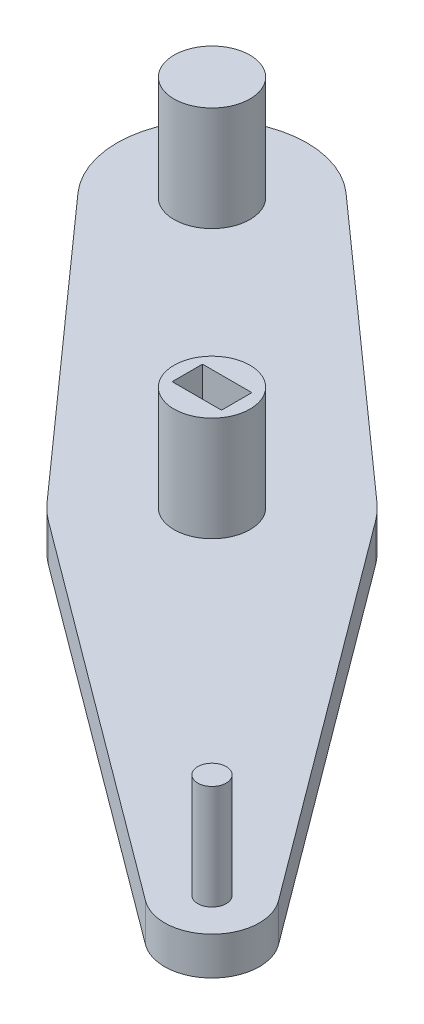
ISO-10303-21;
HEADER;
FILE_DESCRIPTION(('STEP AP214'),'2;1');
FILE_NAME('part.step','',(''),(''),'','','');
FILE_SCHEMA(('AUTOMOTIVE_DESIGN { 1 0 10303 214 1 1 1 1 }'));
ENDSEC;
DATA;
#1=APPLICATION_CONTEXT('core data for automotive mechanical design processes');
#2=APPLICATION_PROTOCOL_DEFINITION('international standard','automotive_design',2000,#1);
#3=PRODUCT_CONTEXT('',#1,'mechanical');
#4=PRODUCT('Part','Part','',(#3));
#5=PRODUCT_RELATED_PRODUCT_CATEGORY('part','',(#4));
#6=PRODUCT_DEFINITION_FORMATION('','',#4);
#7=PRODUCT_DEFINITION_CONTEXT('part definition',#1,'design');
#8=PRODUCT_DEFINITION('design','',#6,#7);
#9=PRODUCT_DEFINITION_SHAPE('','',#8);
#10=(LENGTH_UNIT() NAMED_UNIT(*) SI_UNIT(.MILLI.,.METRE.));
#11=(NAMED_UNIT(*) PLANE_ANGLE_UNIT() SI_UNIT($,.RADIAN.));
#12=(NAMED_UNIT(*) SI_UNIT($,.STERADIAN.) SOLID_ANGLE_UNIT());
#13=UNCERTAINTY_MEASURE_WITH_UNIT(LENGTH_MEASURE(1.E-05),#10,'distance_accuracy_value','');
#14=(GEOMETRIC_REPRESENTATION_CONTEXT(3) GLOBAL_UNCERTAINTY_ASSIGNED_CONTEXT((#13)) GLOBAL_UNIT_ASSIGNED_CONTEXT((#10,
#11,#12)) REPRESENTATION_CONTEXT('',''));
#15=CARTESIAN_POINT('',(0.,0.,0.));
#16=DIRECTION('',(0.,0.,1.));
#17=DIRECTION('',(1.,0.,0.));
#18=AXIS2_PLACEMENT_3D('',#15,#16,#17);
#19=CARTESIAN_POINT('',(0.,4.,0.));
#20=DIRECTION('',(0.,1.,0.));
#21=DIRECTION('',(0.,0.,1.));
#22=AXIS2_PLACEMENT_3D('',#19,#20,#21);
#23=PLANE('',#22);
#24=CARTESIAN_POINT('',(0.,4.,-7.5));
#25=DIRECTION('',(0.,1.,0.));
#26=DIRECTION('',(0.,0.,1.));
#27=AXIS2_PLACEMENT_3D('',#24,#25,#26);
#28=CIRCLE('',#27,1.5);
#29=CARTESIAN_POINT('',(0.,4.,-6.));
#30=VERTEX_POINT('',#29);
#31=EDGE_CURVE('E314',#30,#30,#28,.T.);
#32=ORIENTED_EDGE('',*,*,#31,.F.);
#33=EDGE_LOOP('',(#32));
#34=FACE_BOUND('',#33,.T.);
#35=CARTESIAN_POINT('',(-35.3553390593273,4.,-42.8553390593274));
#36=DIRECTION('',(0.,1.,0.));
#37=DIRECTION('',(0.,0.,1.));
#38=AXIS2_PLACEMENT_3D('',#35,#36,#37);
#39=CIRCLE('',#38,4.00000000000001);
#40=CARTESIAN_POINT('',(-35.3553390593273,4.,-38.8553390593274));
#41=VERTEX_POINT('',#40);
#42=EDGE_CURVE('E320',#41,#41,#39,.T.);
#43=ORIENTED_EDGE('',*,*,#42,.F.);
#44=EDGE_LOOP('',(#43));
#45=FACE_BOUND('',#44,.T.);
#46=CARTESIAN_POINT('',(-63.6396103067894,4.,-71.1396103067892));
#47=DIRECTION('',(0.,1.,0.));
#48=DIRECTION('',(0.,0.,1.));
#49=AXIS2_PLACEMENT_3D('',#46,#47,#48);
#50=CIRCLE('',#49,4.00000000000001);
#51=CARTESIAN_POINT('',(-63.6396103067894,4.,-67.1396103067892));
#52=VERTEX_POINT('',#51);
#53=EDGE_CURVE('E323',#52,#52,#50,.T.);
#54=ORIENTED_EDGE('',*,*,#53,.F.);
#55=EDGE_LOOP('',(#54));
#56=FACE_BOUND('',#55,.T.);
#57=CARTESIAN_POINT('',(-35.3553390593273,4.,-42.8553390593274));
#58=DIRECTION('',(0.,1.,0.));
#59=DIRECTION('',(0.,0.,1.));
#60=AXIS2_PLACEMENT_3D('',#57,#58,#59);
#61=CIRCLE('',#60,12.3);
#62=CARTESIAN_POINT('',(-27.1724167371974,4.,-52.0384639234458));
#63=VERTEX_POINT('',#62);
#64=CARTESIAN_POINT('',(-25.481299643741,4.,-50.1897337596042));
#65=VERTEX_POINT('',#64);
#66=EDGE_CURVE('E332',#63,#65,#61,.F.);
#67=ORIENTED_EDGE('',*,*,#66,.F.);
#68=DIRECTION('',(0.746595517407996,0.,0.665278237571535));
#69=VECTOR('',#68,1.);
#70=CARTESIAN_POINT('',(13.8208003801483,4.,-15.5101234762694));
#71=LINE('',#70,#69);
#72=CARTESIAN_POINT('',(-56.986827931074,4.,-78.6055654808691));
#73=VERTEX_POINT('',#72);
#74=EDGE_CURVE('E335',#73,#63,#71,.T.);
#75=ORIENTED_EDGE('',*,*,#74,.F.);
#76=CARTESIAN_POINT('',(-63.6396103067894,4.,-71.1396103067892));
#77=DIRECTION('',(0.,1.,0.));
#78=DIRECTION('',(0.,0.,1.));
#79=AXIS2_PLACEMENT_3D('',#76,#77,#78);
#80=CIRCLE('',#79,10.);
#81=CARTESIAN_POINT('',(-71.1055654808693,4.,-64.4868279310737));
#82=VERTEX_POINT('',#81);
#83=EDGE_CURVE('E339',#82,#73,#80,.F.);
#84=ORIENTED_EDGE('',*,*,#83,.F.);
#85=DIRECTION('',(0.665278237571543,0.,0.746595517407988));
#86=VECTOR('',#85,1.);
#87=CARTESIAN_POINT('',(-7.60438385166593,4.,6.77613375475068));
#88=LINE('',#87,#86);
#89=CARTESIAN_POINT('',(-44.5384639234456,4.,-34.6724167371975));
#90=VERTEX_POINT('',#89);
#91=EDGE_CURVE('E342',#82,#90,#88,.T.);
#92=ORIENTED_EDGE('',*,*,#91,.T.);
#93=CARTESIAN_POINT('',(-35.3553390593273,4.,-42.8553390593274));
#94=DIRECTION('',(0.,1.,0.));
#95=DIRECTION('',(0.,0.,1.));
#96=AXIS2_PLACEMENT_3D('',#93,#94,#95);
#97=CIRCLE('',#96,12.3);
#98=CARTESIAN_POINT('',(-42.6897337596041,4.,-32.9812996437411));
#99=VERTEX_POINT('',#98);
#100=EDGE_CURVE('E344',#90,#99,#97,.T.);
#101=ORIENTED_EDGE('',*,*,#100,.T.);
#102=DIRECTION('',(0.80276743216149,0.,0.59629225205502));
#103=VECTOR('',#102,1.);
#104=CARTESIAN_POINT('',(0.608668739724902,4.,-0.819429465236192));
#105=LINE('',#104,#103);
#106=CARTESIAN_POINT('',(-2.9814612602751,4.,-3.48616283919255));
#107=VERTEX_POINT('',#106);
#108=EDGE_CURVE('E346',#99,#107,#105,.T.);
#109=ORIENTED_EDGE('',*,*,#108,.T.);
#110=CARTESIAN_POINT('',(0.,4.,-7.5));
#111=DIRECTION('',(0.,1.,0.));
#112=DIRECTION('',(0.,0.,1.));
#113=AXIS2_PLACEMENT_3D('',#110,#111,#112);
#114=CIRCLE('',#113,5.);
#115=CARTESIAN_POINT('',(4.01383716080746,4.,-10.4814612602751));
#116=VERTEX_POINT('',#115);
#117=EDGE_CURVE('E348',#107,#116,#114,.T.);
#118=ORIENTED_EDGE('',*,*,#117,.T.);
#119=DIRECTION('',(0.596292252055018,0.,0.802767432161492));
#120=VECTOR('',#119,1.);
#121=CARTESIAN_POINT('',(7.60396716080746,4.,-5.64819463423143));
#122=LINE('',#121,#120);
#123=EDGE_CURVE('E350',#65,#116,#122,.T.);
#124=ORIENTED_EDGE('',*,*,#123,.F.);
#125=EDGE_LOOP('',(#67,#75,#84,#92,#101,#109,#118,#124));
#126=FACE_BOUND('',#125,.T.);
#127=ADVANCED_FACE('F189',(#34,#45,#56,#126),#23,.T.);
#128=CARTESIAN_POINT('',(0.,0.,0.));
#129=DIRECTION('',(0.,1.,0.));
#130=DIRECTION('',(0.,0.,1.));
#131=AXIS2_PLACEMENT_3D('',#128,#129,#130);
#132=PLANE('',#131);
#133=DIRECTION('',(1.,0.,0.));
#134=VECTOR('',#133,1.);
#135=CARTESIAN_POINT('',(-37.9553390593273,0.,-41.2553390593274));
#136=LINE('',#135,#134);
#137=CARTESIAN_POINT('',(-37.9553390593273,0.,-41.2553390593274));
#138=VERTEX_POINT('',#137);
#139=CARTESIAN_POINT('',(-32.7553390593273,0.,-41.2553390593274));
#140=VERTEX_POINT('',#139);
#141=EDGE_CURVE('E285',#138,#140,#136,.T.);
#142=ORIENTED_EDGE('',*,*,#141,.T.);
#143=DIRECTION('',(0.,0.,-1.));
#144=VECTOR('',#143,1.);
#145=CARTESIAN_POINT('',(-32.7553390593273,0.,-41.2553390593274));
#146=LINE('',#145,#144);
#147=CARTESIAN_POINT('',(-32.7553390593273,0.,-44.4553390593274));
#148=VERTEX_POINT('',#147);
#149=EDGE_CURVE('E279',#140,#148,#146,.T.);
#150=ORIENTED_EDGE('',*,*,#149,.T.);
#151=DIRECTION('',(-1.,0.,0.));
#152=VECTOR('',#151,1.);
#153=CARTESIAN_POINT('',(-37.9553390593273,0.,-44.4553390593274));
#154=LINE('',#153,#152);
#155=CARTESIAN_POINT('',(-37.9553390593273,0.,-44.4553390593274));
#156=VERTEX_POINT('',#155);
#157=EDGE_CURVE('E288',#148,#156,#154,.T.);
#158=ORIENTED_EDGE('',*,*,#157,.T.);
#159=DIRECTION('',(0.,0.,1.));
#160=VECTOR('',#159,1.);
#161=CARTESIAN_POINT('',(-37.9553390593273,0.,-41.2553390593274));
#162=LINE('',#161,#160);
#163=EDGE_CURVE('E204',#156,#138,#162,.T.);
#164=ORIENTED_EDGE('',*,*,#163,.T.);
#165=EDGE_LOOP('',(#142,#150,#158,#164));
#166=FACE_BOUND('',#165,.T.);
#167=CARTESIAN_POINT('',(-35.3553390593273,0.,-42.8553390593274));
#168=DIRECTION('',(0.,1.,0.));
#169=DIRECTION('',(0.,0.,1.));
#170=AXIS2_PLACEMENT_3D('',#167,#168,#169);
#171=CIRCLE('',#170,12.3);
#172=CARTESIAN_POINT('',(-27.1724167371974,0.,-52.0384639234458));
#173=VERTEX_POINT('',#172);
#174=CARTESIAN_POINT('',(-25.481299643741,0.,-50.1897337596042));
#175=VERTEX_POINT('',#174);
#176=EDGE_CURVE('E329',#173,#175,#171,.F.);
#177=ORIENTED_EDGE('',*,*,#176,.T.);
#178=DIRECTION('',(0.596292252055018,0.,0.802767432161492));
#179=VECTOR('',#178,1.);
#180=CARTESIAN_POINT('',(7.60396716080746,0.,-5.64819463423143));
#181=LINE('',#180,#179);
#182=CARTESIAN_POINT('',(4.01383716080746,0.,-10.4814612602751));
#183=VERTEX_POINT('',#182);
#184=EDGE_CURVE('E336',#175,#183,#181,.T.);
#185=ORIENTED_EDGE('',*,*,#184,.T.);
#186=CARTESIAN_POINT('',(0.,0.,-7.5));
#187=DIRECTION('',(0.,1.,0.));
#188=DIRECTION('',(0.,0.,1.));
#189=AXIS2_PLACEMENT_3D('',#186,#187,#188);
#190=CIRCLE('',#189,5.);
#191=CARTESIAN_POINT('',(-2.9814612602751,0.,-3.48616283919255));
#192=VERTEX_POINT('',#191);
#193=EDGE_CURVE('E368',#192,#183,#190,.T.);
#194=ORIENTED_EDGE('',*,*,#193,.F.);
#195=DIRECTION('',(0.80276743216149,0.,0.59629225205502));
#196=VECTOR('',#195,1.);
#197=CARTESIAN_POINT('',(0.608668739724902,0.,-0.819429465236192));
#198=LINE('',#197,#196);
#199=CARTESIAN_POINT('',(-42.6897337596041,0.,-32.9812996437411));
#200=VERTEX_POINT('',#199);
#201=EDGE_CURVE('E366',#200,#192,#198,.T.);
#202=ORIENTED_EDGE('',*,*,#201,.F.);
#203=CARTESIAN_POINT('',(-35.3553390593273,0.,-42.8553390593274));
#204=DIRECTION('',(0.,1.,0.));
#205=DIRECTION('',(0.,0.,1.));
#206=AXIS2_PLACEMENT_3D('',#203,#204,#205);
#207=CIRCLE('',#206,12.3);
#208=CARTESIAN_POINT('',(-44.5384639234456,0.,-34.6724167371975));
#209=VERTEX_POINT('',#208);
#210=EDGE_CURVE('E364',#209,#200,#207,.T.);
#211=ORIENTED_EDGE('',*,*,#210,.F.);
#212=DIRECTION('',(0.665278237571543,0.,0.746595517407988));
#213=VECTOR('',#212,1.);
#214=CARTESIAN_POINT('',(-7.60438385166593,0.,6.77613375475068));
#215=LINE('',#214,#213);
#216=CARTESIAN_POINT('',(-71.1055654808693,0.,-64.4868279310737));
#217=VERTEX_POINT('',#216);
#218=EDGE_CURVE('E362',#217,#209,#215,.T.);
#219=ORIENTED_EDGE('',*,*,#218,.F.);
#220=CARTESIAN_POINT('',(-63.6396103067894,0.,-71.1396103067892));
#221=DIRECTION('',(0.,1.,0.));
#222=DIRECTION('',(0.,0.,1.));
#223=AXIS2_PLACEMENT_3D('',#220,#221,#222);
#224=CIRCLE('',#223,10.);
#225=CARTESIAN_POINT('',(-56.986827931074,0.,-78.6055654808691));
#226=VERTEX_POINT('',#225);
#227=EDGE_CURVE('E359',#217,#226,#224,.F.);
#228=ORIENTED_EDGE('',*,*,#227,.T.);
#229=DIRECTION('',(0.746595517407996,0.,0.665278237571535));
#230=VECTOR('',#229,1.);
#231=CARTESIAN_POINT('',(13.8208003801483,0.,-15.5101234762694));
#232=LINE('',#231,#230);
#233=EDGE_CURVE('E356',#226,#173,#232,.T.);
#234=ORIENTED_EDGE('',*,*,#233,.T.);
#235=EDGE_LOOP('',(#177,#185,#194,#202,#211,#219,#228,#234));
#236=FACE_BOUND('',#235,.T.);
#237=ADVANCED_FACE('F292',(#166,#236),#132,.F.);
#238=CARTESIAN_POINT('',(13.8208003801483,4.,-15.5101234762694));
#239=DIRECTION('',(0.665278237571535,0.,-0.746595517407996));
#240=DIRECTION('',(-0.746595517407996,0.,-0.665278237571535));
#241=AXIS2_PLACEMENT_3D('',#238,#239,#240);
#242=PLANE('',#241);
#243=ORIENTED_EDGE('',*,*,#233,.F.);
#244=DIRECTION('',(0.,-1.,0.));
#245=VECTOR('',#244,1.);
#246=CARTESIAN_POINT('',(-56.986827931074,4.,-78.6055654808691));
#247=LINE('',#246,#245);
#248=EDGE_CURVE('E197',#73,#226,#247,.T.);
#249=ORIENTED_EDGE('',*,*,#248,.F.);
#250=ORIENTED_EDGE('',*,*,#74,.T.);
#251=DIRECTION('',(0.,-1.,0.));
#252=VECTOR('',#251,1.);
#253=CARTESIAN_POINT('',(-27.1724167371974,4.,-52.0384639234458));
#254=LINE('',#253,#252);
#255=EDGE_CURVE('E12',#63,#173,#254,.T.);
#256=ORIENTED_EDGE('',*,*,#255,.T.);
#257=EDGE_LOOP('',(#243,#249,#250,#256));
#258=FACE_BOUND('',#257,.T.);
#259=ADVANCED_FACE('F393',(#258),#242,.T.);
#260=CARTESIAN_POINT('',(-63.6396103067894,4.,-71.1396103067892));
#261=DIRECTION('',(0.,-1.,0.));
#262=DIRECTION('',(0.,0.,-1.));
#263=AXIS2_PLACEMENT_3D('',#260,#261,#262);
#264=CYLINDRICAL_SURFACE('',#263,10.);
#265=ORIENTED_EDGE('',*,*,#227,.F.);
#266=DIRECTION('',(0.,-1.,0.));
#267=VECTOR('',#266,1.);
#268=CARTESIAN_POINT('',(-71.1055654808693,4.,-64.4868279310737));
#269=LINE('',#268,#267);
#270=EDGE_CURVE('E385',#82,#217,#269,.T.);
#271=ORIENTED_EDGE('',*,*,#270,.F.);
#272=ORIENTED_EDGE('',*,*,#83,.T.);
#273=ORIENTED_EDGE('',*,*,#248,.T.);
#274=EDGE_LOOP('',(#265,#271,#272,#273));
#275=FACE_BOUND('',#274,.T.);
#276=ADVANCED_FACE('F389',(#275),#264,.T.);
#277=CARTESIAN_POINT('',(-7.60438385166593,4.,6.77613375475068));
#278=DIRECTION('',(0.746595517407988,0.,-0.665278237571543));
#279=DIRECTION('',(-0.665278237571543,0.,-0.746595517407988));
#280=AXIS2_PLACEMENT_3D('',#277,#278,#279);
#281=PLANE('',#280);
#282=ORIENTED_EDGE('',*,*,#218,.T.);
#283=DIRECTION('',(0.,-1.,0.));
#284=VECTOR('',#283,1.);
#285=CARTESIAN_POINT('',(-44.5384639234456,4.,-34.6724167371975));
#286=LINE('',#285,#284);
#287=EDGE_CURVE('E382',#90,#209,#286,.T.);
#288=ORIENTED_EDGE('',*,*,#287,.F.);
#289=ORIENTED_EDGE('',*,*,#91,.F.);
#290=ORIENTED_EDGE('',*,*,#270,.T.);
#291=EDGE_LOOP('',(#282,#288,#289,#290));
#292=FACE_BOUND('',#291,.T.);
#293=ADVANCED_FACE('F400',(#292),#281,.F.);
#294=CARTESIAN_POINT('',(-35.3553390593273,4.,-42.8553390593274));
#295=DIRECTION('',(0.,-1.,0.));
#296=DIRECTION('',(0.,0.,-1.));
#297=AXIS2_PLACEMENT_3D('',#294,#295,#296);
#298=CYLINDRICAL_SURFACE('',#297,12.3);
#299=ORIENTED_EDGE('',*,*,#210,.T.);
#300=DIRECTION('',(0.,-1.,0.));
#301=VECTOR('',#300,1.);
#302=CARTESIAN_POINT('',(-42.6897337596041,4.,-32.9812996437411));
#303=LINE('',#302,#301);
#304=EDGE_CURVE('E379',#99,#200,#303,.T.);
#305=ORIENTED_EDGE('',*,*,#304,.F.);
#306=ORIENTED_EDGE('',*,*,#100,.F.);
#307=ORIENTED_EDGE('',*,*,#287,.T.);
#308=EDGE_LOOP('',(#299,#305,#306,#307));
#309=FACE_BOUND('',#308,.T.);
#310=ADVANCED_FACE('F404',(#309),#298,.T.);
#311=CARTESIAN_POINT('',(0.608668739724902,4.,-0.819429465236192));
#312=DIRECTION('',(0.59629225205502,0.,-0.80276743216149));
#313=DIRECTION('',(-0.80276743216149,0.,-0.59629225205502));
#314=AXIS2_PLACEMENT_3D('',#311,#312,#313);
#315=PLANE('',#314);
#316=ORIENTED_EDGE('',*,*,#201,.T.);
#317=DIRECTION('',(0.,-1.,0.));
#318=VECTOR('',#317,1.);
#319=CARTESIAN_POINT('',(-2.9814612602751,4.,-3.48616283919255));
#320=LINE('',#319,#318);
#321=EDGE_CURVE('E376',#107,#192,#320,.T.);
#322=ORIENTED_EDGE('',*,*,#321,.F.);
#323=ORIENTED_EDGE('',*,*,#108,.F.);
#324=ORIENTED_EDGE('',*,*,#304,.T.);
#325=EDGE_LOOP('',(#316,#322,#323,#324));
#326=FACE_BOUND('',#325,.T.);
#327=ADVANCED_FACE('F421',(#326),#315,.F.);
#328=CARTESIAN_POINT('',(0.,4.,-7.5));
#329=DIRECTION('',(0.,-1.,0.));
#330=DIRECTION('',(0.,0.,-1.));
#331=AXIS2_PLACEMENT_3D('',#328,#329,#330);
#332=CYLINDRICAL_SURFACE('',#331,5.);
#333=ORIENTED_EDGE('',*,*,#193,.T.);
#334=DIRECTION('',(0.,-1.,0.));
#335=VECTOR('',#334,1.);
#336=CARTESIAN_POINT('',(4.01383716080746,4.,-10.4814612602751));
#337=LINE('',#336,#335);
#338=EDGE_CURVE('E374',#116,#183,#337,.T.);
#339=ORIENTED_EDGE('',*,*,#338,.F.);
#340=ORIENTED_EDGE('',*,*,#117,.F.);
#341=ORIENTED_EDGE('',*,*,#321,.T.);
#342=EDGE_LOOP('',(#333,#339,#340,#341));
#343=FACE_BOUND('',#342,.T.);
#344=ADVANCED_FACE('F419',(#343),#332,.T.);
#345=CARTESIAN_POINT('',(7.60396716080746,4.,-5.64819463423143));
#346=DIRECTION('',(0.802767432161492,0.,-0.596292252055018));
#347=DIRECTION('',(-0.596292252055018,0.,-0.802767432161492));
#348=AXIS2_PLACEMENT_3D('',#345,#346,#347);
#349=PLANE('',#348);
#350=ORIENTED_EDGE('',*,*,#184,.F.);
#351=DIRECTION('',(0.,-1.,0.));
#352=VECTOR('',#351,1.);
#353=CARTESIAN_POINT('',(-25.481299643741,4.,-50.1897337596042));
#354=LINE('',#353,#352);
#355=EDGE_CURVE('E353',#65,#175,#354,.T.);
#356=ORIENTED_EDGE('',*,*,#355,.F.);
#357=ORIENTED_EDGE('',*,*,#123,.T.);
#358=ORIENTED_EDGE('',*,*,#338,.T.);
#359=EDGE_LOOP('',(#350,#356,#357,#358));
#360=FACE_BOUND('',#359,.T.);
#361=ADVANCED_FACE('F415',(#360),#349,.T.);
#362=CARTESIAN_POINT('',(-35.3553390593273,4.,-42.8553390593274));
#363=DIRECTION('',(0.,-1.,0.));
#364=DIRECTION('',(0.,0.,-1.));
#365=AXIS2_PLACEMENT_3D('',#362,#363,#364);
#366=CYLINDRICAL_SURFACE('',#365,12.3);
#367=ORIENTED_EDGE('',*,*,#176,.F.);
#368=ORIENTED_EDGE('',*,*,#255,.F.);
#369=ORIENTED_EDGE('',*,*,#66,.T.);
#370=ORIENTED_EDGE('',*,*,#355,.T.);
#371=EDGE_LOOP('',(#367,#368,#369,#370));
#372=FACE_BOUND('',#371,.T.);
#373=ADVANCED_FACE('F191',(#372),#366,.T.);
#374=CARTESIAN_POINT('',(-63.6396103067894,15.,-71.1396103067892));
#375=DIRECTION('',(0.,-1.,0.));
#376=DIRECTION('',(0.,0.,-1.));
#377=AXIS2_PLACEMENT_3D('',#374,#375,#376);
#378=CYLINDRICAL_SURFACE('',#377,4.00000000000001);
#379=CARTESIAN_POINT('',(-63.6396103067894,15.,-71.1396103067892));
#380=DIRECTION('',(0.,1.,0.));
#381=DIRECTION('',(0.,0.,1.));
#382=AXIS2_PLACEMENT_3D('',#379,#380,#381);
#383=CIRCLE('',#382,4.00000000000001);
#384=CARTESIAN_POINT('',(-63.6396103067894,15.,-67.1396103067892));
#385=VERTEX_POINT('',#384);
#386=EDGE_CURVE('E326',#385,#385,#383,.T.);
#387=ORIENTED_EDGE('',*,*,#386,.F.);
#388=EDGE_LOOP('',(#387));
#389=FACE_BOUND('',#388,.T.);
#390=ORIENTED_EDGE('',*,*,#53,.T.);
#391=EDGE_LOOP('',(#390));
#392=FACE_BOUND('',#391,.T.);
#393=ADVANCED_FACE('F438',(#389,#392),#378,.T.);
#394=CARTESIAN_POINT('',(0.,15.,0.));
#395=DIRECTION('',(0.,1.,0.));
#396=DIRECTION('',(0.,0.,1.));
#397=AXIS2_PLACEMENT_3D('',#394,#395,#396);
#398=PLANE('',#397);
#399=ORIENTED_EDGE('',*,*,#386,.T.);
#400=EDGE_LOOP('',(#399));
#401=FACE_BOUND('',#400,.T.);
#402=ADVANCED_FACE('F448',(#401),#398,.T.);
#403=CARTESIAN_POINT('',(-35.3553390593273,15.,-42.8553390593274));
#404=DIRECTION('',(0.,-1.,0.));
#405=DIRECTION('',(0.,0.,-1.));
#406=AXIS2_PLACEMENT_3D('',#403,#404,#405);
#407=CYLINDRICAL_SURFACE('',#406,4.00000000000001);
#408=CARTESIAN_POINT('',(-35.3553390593273,15.,-42.8553390593274));
#409=DIRECTION('',(0.,1.,0.));
#410=DIRECTION('',(0.,0.,1.));
#411=AXIS2_PLACEMENT_3D('',#408,#409,#410);
#412=CIRCLE('',#411,4.00000000000001);
#413=CARTESIAN_POINT('',(-35.3553390593273,15.,-38.8553390593274));
#414=VERTEX_POINT('',#413);
#415=EDGE_CURVE('E317',#414,#414,#412,.T.);
#416=ORIENTED_EDGE('',*,*,#415,.F.);
#417=EDGE_LOOP('',(#416));
#418=FACE_BOUND('',#417,.T.);
#419=ORIENTED_EDGE('',*,*,#42,.T.);
#420=EDGE_LOOP('',(#419));
#421=FACE_BOUND('',#420,.T.);
#422=ADVANCED_FACE('F453',(#418,#421),#407,.T.);
#423=CARTESIAN_POINT('',(0.,15.,0.));
#424=DIRECTION('',(0.,1.,0.));
#425=DIRECTION('',(0.,0.,1.));
#426=AXIS2_PLACEMENT_3D('',#423,#424,#425);
#427=PLANE('',#426);
#428=DIRECTION('',(0.,0.,-1.));
#429=VECTOR('',#428,1.);
#430=CARTESIAN_POINT('',(-32.7553390593273,15.,-41.2553390593274));
#431=LINE('',#430,#429);
#432=CARTESIAN_POINT('',(-32.7553390593273,15.,-41.2553390593274));
#433=VERTEX_POINT('',#432);
#434=CARTESIAN_POINT('',(-32.7553390593273,15.,-44.4553390593274));
#435=VERTEX_POINT('',#434);
#436=EDGE_CURVE('E212',#433,#435,#431,.T.);
#437=ORIENTED_EDGE('',*,*,#436,.F.);
#438=DIRECTION('',(1.,0.,0.));
#439=VECTOR('',#438,1.);
#440=CARTESIAN_POINT('',(-37.9553390593273,15.,-41.2553390593274));
#441=LINE('',#440,#439);
#442=CARTESIAN_POINT('',(-37.9553390593273,15.,-41.2553390593274));
#443=VERTEX_POINT('',#442);
#444=EDGE_CURVE('E295',#443,#433,#441,.T.);
#445=ORIENTED_EDGE('',*,*,#444,.F.);
#446=DIRECTION('',(0.,0.,1.));
#447=VECTOR('',#446,1.);
#448=CARTESIAN_POINT('',(-37.9553390593273,15.,-41.2553390593274));
#449=LINE('',#448,#447);
#450=CARTESIAN_POINT('',(-37.9553390593273,15.,-44.4553390593274));
#451=VERTEX_POINT('',#450);
#452=EDGE_CURVE('E298',#451,#443,#449,.T.);
#453=ORIENTED_EDGE('',*,*,#452,.F.);
#454=DIRECTION('',(-1.,0.,0.));
#455=VECTOR('',#454,1.);
#456=CARTESIAN_POINT('',(-37.9553390593273,15.,-44.4553390593274));
#457=LINE('',#456,#455);
#458=EDGE_CURVE('E304',#435,#451,#457,.T.);
#459=ORIENTED_EDGE('',*,*,#458,.F.);
#460=EDGE_LOOP('',(#437,#445,#453,#459));
#461=FACE_BOUND('',#460,.T.);
#462=ORIENTED_EDGE('',*,*,#415,.T.);
#463=EDGE_LOOP('',(#462));
#464=FACE_BOUND('',#463,.T.);
#465=ADVANCED_FACE('F459',(#461,#464),#427,.T.);
#466=CARTESIAN_POINT('',(0.,15.,-7.5));
#467=DIRECTION('',(0.,-1.,0.));
#468=DIRECTION('',(0.,0.,-1.));
#469=AXIS2_PLACEMENT_3D('',#466,#467,#468);
#470=CYLINDRICAL_SURFACE('',#469,1.5);
#471=CARTESIAN_POINT('',(0.,15.,-7.5));
#472=DIRECTION('',(0.,1.,0.));
#473=DIRECTION('',(0.,0.,1.));
#474=AXIS2_PLACEMENT_3D('',#471,#472,#473);
#475=CIRCLE('',#474,1.5);
#476=CARTESIAN_POINT('',(0.,15.,-6.));
#477=VERTEX_POINT('',#476);
#478=EDGE_CURVE('E310',#477,#477,#475,.T.);
#479=ORIENTED_EDGE('',*,*,#478,.F.);
#480=EDGE_LOOP('',(#479));
#481=FACE_BOUND('',#480,.T.);
#482=ORIENTED_EDGE('',*,*,#31,.T.);
#483=EDGE_LOOP('',(#482));
#484=FACE_BOUND('',#483,.T.);
#485=ADVANCED_FACE('F462',(#481,#484),#470,.T.);
#486=CARTESIAN_POINT('',(0.,15.,-7.5));
#487=DIRECTION('',(0.,1.,0.));
#488=DIRECTION('',(0.,0.,1.));
#489=AXIS2_PLACEMENT_3D('',#486,#487,#488);
#490=PLANE('',#489);
#491=ORIENTED_EDGE('',*,*,#478,.T.);
#492=EDGE_LOOP('',(#491));
#493=FACE_BOUND('',#492,.T.);
#494=ADVANCED_FACE('F467',(#493),#490,.T.);
#495=CARTESIAN_POINT('',(-32.7553390593273,0.,-41.2553390593274));
#496=DIRECTION('',(1.,0.,0.));
#497=DIRECTION('',(0.,0.,-1.));
#498=AXIS2_PLACEMENT_3D('',#495,#496,#497);
#499=PLANE('',#498);
#500=ORIENTED_EDGE('',*,*,#436,.T.);
#501=DIRECTION('',(0.,1.,0.));
#502=VECTOR('',#501,1.);
#503=CARTESIAN_POINT('',(-32.7553390593273,0.,-44.4553390593274));
#504=LINE('',#503,#502);
#505=EDGE_CURVE('E275',#148,#435,#504,.T.);
#506=ORIENTED_EDGE('',*,*,#505,.F.);
#507=ORIENTED_EDGE('',*,*,#149,.F.);
#508=DIRECTION('',(0.,1.,0.));
#509=VECTOR('',#508,1.);
#510=CARTESIAN_POINT('',(-32.7553390593273,0.,-41.2553390593274));
#511=LINE('',#510,#509);
#512=EDGE_CURVE('E308',#140,#433,#511,.T.);
#513=ORIENTED_EDGE('',*,*,#512,.T.);
#514=EDGE_LOOP('',(#500,#506,#507,#513));
#515=FACE_BOUND('',#514,.T.);
#516=ADVANCED_FACE('F277',(#515),#499,.F.);
#517=CARTESIAN_POINT('',(-37.9553390593273,0.,-41.2553390593274));
#518=DIRECTION('',(0.,0.,1.));
#519=DIRECTION('',(1.,0.,0.));
#520=AXIS2_PLACEMENT_3D('',#517,#518,#519);
#521=PLANE('',#520);
#522=ORIENTED_EDGE('',*,*,#444,.T.);
#523=ORIENTED_EDGE('',*,*,#512,.F.);
#524=ORIENTED_EDGE('',*,*,#141,.F.);
#525=DIRECTION('',(0.,1.,0.));
#526=VECTOR('',#525,1.);
#527=CARTESIAN_POINT('',(-37.9553390593273,0.,-41.2553390593274));
#528=LINE('',#527,#526);
#529=EDGE_CURVE('E311',#138,#443,#528,.T.);
#530=ORIENTED_EDGE('',*,*,#529,.T.);
#531=EDGE_LOOP('',(#522,#523,#524,#530));
#532=FACE_BOUND('',#531,.T.);
#533=ADVANCED_FACE('F476',(#532),#521,.F.);
#534=CARTESIAN_POINT('',(-37.9553390593273,0.,-41.2553390593274));
#535=DIRECTION('',(-1.,0.,0.));
#536=DIRECTION('',(0.,0.,1.));
#537=AXIS2_PLACEMENT_3D('',#534,#535,#536);
#538=PLANE('',#537);
#539=ORIENTED_EDGE('',*,*,#452,.T.);
#540=ORIENTED_EDGE('',*,*,#529,.F.);
#541=ORIENTED_EDGE('',*,*,#163,.F.);
#542=DIRECTION('',(0.,1.,0.));
#543=VECTOR('',#542,1.);
#544=CARTESIAN_POINT('',(-37.9553390593273,0.,-44.4553390593274));
#545=LINE('',#544,#543);
#546=EDGE_CURVE('E284',#156,#451,#545,.T.);
#547=ORIENTED_EDGE('',*,*,#546,.T.);
#548=EDGE_LOOP('',(#539,#540,#541,#547));
#549=FACE_BOUND('',#548,.T.);
#550=ADVANCED_FACE('F479',(#549),#538,.F.);
#551=CARTESIAN_POINT('',(-37.9553390593273,0.,-44.4553390593274));
#552=DIRECTION('',(0.,0.,-1.));
#553=DIRECTION('',(-1.,0.,0.));
#554=AXIS2_PLACEMENT_3D('',#551,#552,#553);
#555=PLANE('',#554);
#556=ORIENTED_EDGE('',*,*,#458,.T.);
#557=ORIENTED_EDGE('',*,*,#546,.F.);
#558=ORIENTED_EDGE('',*,*,#157,.F.);
#559=ORIENTED_EDGE('',*,*,#505,.T.);
#560=EDGE_LOOP('',(#556,#557,#558,#559));
#561=FACE_BOUND('',#560,.T.);
#562=ADVANCED_FACE('F289',(#561),#555,.F.);
#563=CLOSED_SHELL('',(#127,#237,#259,#276,#293,#310,#327,#344,#361,#373,#393,#402,#422,#465,
#485,#494,#516,#533,#550,#562));
#564=MANIFOLD_SOLID_BREP('B2',#563);
#565=ADVANCED_BREP_SHAPE_REPRESENTATION('',(#18,#564),#14);
#566=SHAPE_DEFINITION_REPRESENTATION(#9,#565);
ENDSEC;
END-ISO-10303-21;
